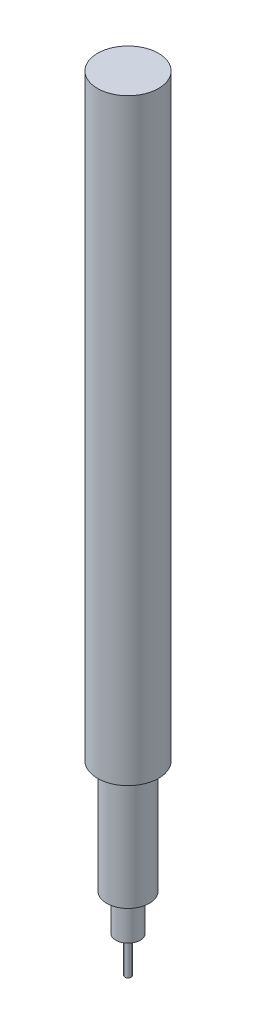
ISO-10303-21;
HEADER;
FILE_DESCRIPTION(('STEP AP214'),'2;1');
FILE_NAME('part.step','',(''),(''),'','','');
FILE_SCHEMA(('AUTOMOTIVE_DESIGN { 1 0 10303 214 1 1 1 1 }'));
ENDSEC;
DATA;
#1=APPLICATION_CONTEXT('core data for automotive mechanical design processes');
#2=APPLICATION_PROTOCOL_DEFINITION('international standard','automotive_design',2000,#1);
#3=PRODUCT_CONTEXT('',#1,'mechanical');
#4=PRODUCT('Part','Part','',(#3));
#5=PRODUCT_RELATED_PRODUCT_CATEGORY('part','',(#4));
#6=PRODUCT_DEFINITION_FORMATION('','',#4);
#7=PRODUCT_DEFINITION_CONTEXT('part definition',#1,'design');
#8=PRODUCT_DEFINITION('design','',#6,#7);
#9=PRODUCT_DEFINITION_SHAPE('','',#8);
#10=(LENGTH_UNIT() NAMED_UNIT(*) SI_UNIT(.MILLI.,.METRE.));
#11=(NAMED_UNIT(*) PLANE_ANGLE_UNIT() SI_UNIT($,.RADIAN.));
#12=(NAMED_UNIT(*) SI_UNIT($,.STERADIAN.) SOLID_ANGLE_UNIT());
#13=UNCERTAINTY_MEASURE_WITH_UNIT(LENGTH_MEASURE(1.E-05),#10,'distance_accuracy_value','');
#14=(GEOMETRIC_REPRESENTATION_CONTEXT(3) GLOBAL_UNCERTAINTY_ASSIGNED_CONTEXT((#13)) GLOBAL_UNIT_ASSIGNED_CONTEXT((#10,
#11,#12)) REPRESENTATION_CONTEXT('',''));
#15=CARTESIAN_POINT('',(0.,0.,0.));
#16=DIRECTION('',(0.,0.,1.));
#17=DIRECTION('',(1.,0.,0.));
#18=AXIS2_PLACEMENT_3D('',#15,#16,#17);
#19=CARTESIAN_POINT('',(0.,0.,0.));
#20=DIRECTION('',(0.,-1.,0.));
#21=DIRECTION('',(0.,0.,-1.));
#22=AXIS2_PLACEMENT_3D('',#19,#20,#21);
#23=PLANE('',#22);
#24=CARTESIAN_POINT('',(0.,0.,0.));
#25=DIRECTION('',(0.,-1.,0.));
#26=DIRECTION('',(0.,0.,-1.));
#27=AXIS2_PLACEMENT_3D('',#24,#25,#26);
#28=CIRCLE('',#27,0.5);
#29=CARTESIAN_POINT('',(0.,0.,-0.5));
#30=VERTEX_POINT('',#29);
#31=EDGE_CURVE('E10',#30,#30,#28,.T.);
#32=ORIENTED_EDGE('',*,*,#31,.T.);
#33=EDGE_LOOP('',(#32));
#34=FACE_BOUND('',#33,.T.);
#35=ADVANCED_FACE('F31',(#34),#23,.T.);
#36=CARTESIAN_POINT('',(0.,0.,0.));
#37=DIRECTION('',(0.,-1.,0.));
#38=DIRECTION('',(0.,0.,-1.));
#39=AXIS2_PLACEMENT_3D('',#36,#37,#38);
#40=CYLINDRICAL_SURFACE('',#39,0.5);
#41=CARTESIAN_POINT('',(0.,5.,0.));
#42=DIRECTION('',(0.,-1.,0.));
#43=DIRECTION('',(0.,0.,-1.));
#44=AXIS2_PLACEMENT_3D('',#41,#42,#43);
#45=CIRCLE('',#44,0.5);
#46=CARTESIAN_POINT('',(0.,5.,-0.5));
#47=VERTEX_POINT('',#46);
#48=EDGE_CURVE('E37',#47,#47,#45,.T.);
#49=ORIENTED_EDGE('',*,*,#48,.T.);
#50=EDGE_LOOP('',(#49));
#51=FACE_BOUND('',#50,.T.);
#52=ORIENTED_EDGE('',*,*,#31,.F.);
#53=EDGE_LOOP('',(#52));
#54=FACE_BOUND('',#53,.T.);
#55=ADVANCED_FACE('F75',(#51,#54),#40,.T.);
#56=CARTESIAN_POINT('',(0.,5.,0.));
#57=DIRECTION('',(0.,1.,0.));
#58=DIRECTION('',(0.,0.,1.));
#59=AXIS2_PLACEMENT_3D('',#56,#57,#58);
#60=CONICAL_SURFACE('',#59,0.5,0.982793723247329);
#61=CARTESIAN_POINT('',(0.,6.,0.));
#62=DIRECTION('',(0.,-1.,0.));
#63=DIRECTION('',(0.,0.,-1.));
#64=AXIS2_PLACEMENT_3D('',#61,#62,#63);
#65=CIRCLE('',#64,2.);
#66=CARTESIAN_POINT('',(0.,6.,-2.));
#67=VERTEX_POINT('',#66);
#68=EDGE_CURVE('E41',#67,#67,#65,.T.);
#69=ORIENTED_EDGE('',*,*,#68,.T.);
#70=EDGE_LOOP('',(#69));
#71=FACE_BOUND('',#70,.T.);
#72=ORIENTED_EDGE('',*,*,#48,.F.);
#73=EDGE_LOOP('',(#72));
#74=FACE_BOUND('',#73,.T.);
#75=ADVANCED_FACE('F79',(#71,#74),#60,.T.);
#76=CARTESIAN_POINT('',(0.,0.,0.));
#77=DIRECTION('',(0.,-1.,0.));
#78=DIRECTION('',(0.,0.,-1.));
#79=AXIS2_PLACEMENT_3D('',#76,#77,#78);
#80=CYLINDRICAL_SURFACE('',#79,2.);
#81=CARTESIAN_POINT('',(0.,12.,0.));
#82=DIRECTION('',(0.,-1.,0.));
#83=DIRECTION('',(0.,0.,-1.));
#84=AXIS2_PLACEMENT_3D('',#81,#82,#83);
#85=CIRCLE('',#84,2.);
#86=CARTESIAN_POINT('',(0.,12.,-2.));
#87=VERTEX_POINT('',#86);
#88=EDGE_CURVE('E45',#87,#87,#85,.T.);
#89=ORIENTED_EDGE('',*,*,#88,.T.);
#90=EDGE_LOOP('',(#89));
#91=FACE_BOUND('',#90,.T.);
#92=ORIENTED_EDGE('',*,*,#68,.F.);
#93=EDGE_LOOP('',(#92));
#94=FACE_BOUND('',#93,.T.);
#95=ADVANCED_FACE('F83',(#91,#94),#80,.T.);
#96=CARTESIAN_POINT('',(2.,12.,0.));
#97=DIRECTION('',(0.,-1.,0.));
#98=DIRECTION('',(0.,0.,-1.));
#99=AXIS2_PLACEMENT_3D('',#96,#97,#98);
#100=PLANE('',#99);
#101=CARTESIAN_POINT('',(0.,12.,0.));
#102=DIRECTION('',(0.,-1.,0.));
#103=DIRECTION('',(0.,0.,-1.));
#104=AXIS2_PLACEMENT_3D('',#101,#102,#103);
#105=CIRCLE('',#104,3.5);
#106=CARTESIAN_POINT('',(0.,12.,-3.5));
#107=VERTEX_POINT('',#106);
#108=EDGE_CURVE('E50',#107,#107,#105,.T.);
#109=ORIENTED_EDGE('',*,*,#108,.T.);
#110=EDGE_LOOP('',(#109));
#111=FACE_BOUND('',#110,.T.);
#112=ORIENTED_EDGE('',*,*,#88,.F.);
#113=EDGE_LOOP('',(#112));
#114=FACE_BOUND('',#113,.T.);
#115=ADVANCED_FACE('F90',(#111,#114),#100,.T.);
#116=CARTESIAN_POINT('',(0.,0.,0.));
#117=DIRECTION('',(0.,-1.,0.));
#118=DIRECTION('',(0.,0.,-1.));
#119=AXIS2_PLACEMENT_3D('',#116,#117,#118);
#120=CYLINDRICAL_SURFACE('',#119,3.5);
#121=CARTESIAN_POINT('',(0.,30.5,0.));
#122=DIRECTION('',(0.,-1.,0.));
#123=DIRECTION('',(0.,0.,-1.));
#124=AXIS2_PLACEMENT_3D('',#121,#122,#123);
#125=CIRCLE('',#124,3.5);
#126=CARTESIAN_POINT('',(0.,30.5,-3.5));
#127=VERTEX_POINT('',#126);
#128=EDGE_CURVE('E53',#127,#127,#125,.T.);
#129=ORIENTED_EDGE('',*,*,#128,.T.);
#130=EDGE_LOOP('',(#129));
#131=FACE_BOUND('',#130,.T.);
#132=ORIENTED_EDGE('',*,*,#108,.F.);
#133=EDGE_LOOP('',(#132));
#134=FACE_BOUND('',#133,.T.);
#135=ADVANCED_FACE('F94',(#131,#134),#120,.T.);
#136=CARTESIAN_POINT('',(3.5,30.5,0.));
#137=DIRECTION('',(0.,-1.,0.));
#138=DIRECTION('',(0.,0.,-1.));
#139=AXIS2_PLACEMENT_3D('',#136,#137,#138);
#140=PLANE('',#139);
#141=CARTESIAN_POINT('',(0.,30.5,0.));
#142=DIRECTION('',(0.,-1.,0.));
#143=DIRECTION('',(0.,0.,-1.));
#144=AXIS2_PLACEMENT_3D('',#141,#142,#143);
#145=CIRCLE('',#144,5.);
#146=CARTESIAN_POINT('',(0.,30.5,-5.));
#147=VERTEX_POINT('',#146);
#148=EDGE_CURVE('E56',#147,#147,#145,.T.);
#149=ORIENTED_EDGE('',*,*,#148,.T.);
#150=EDGE_LOOP('',(#149));
#151=FACE_BOUND('',#150,.T.);
#152=ORIENTED_EDGE('',*,*,#128,.F.);
#153=EDGE_LOOP('',(#152));
#154=FACE_BOUND('',#153,.T.);
#155=ADVANCED_FACE('F72',(#151,#154),#140,.T.);
#156=CARTESIAN_POINT('',(0.,0.,0.));
#157=DIRECTION('',(0.,-1.,0.));
#158=DIRECTION('',(0.,0.,-1.));
#159=AXIS2_PLACEMENT_3D('',#156,#157,#158);
#160=CYLINDRICAL_SURFACE('',#159,5.);
#161=CARTESIAN_POINT('',(0.,128.5,0.));
#162=DIRECTION('',(0.,-1.,0.));
#163=DIRECTION('',(0.,0.,-1.));
#164=AXIS2_PLACEMENT_3D('',#161,#162,#163);
#165=CIRCLE('',#164,5.);
#166=CARTESIAN_POINT('',(0.,128.5,-5.));
#167=VERTEX_POINT('',#166);
#168=EDGE_CURVE('E59',#167,#167,#165,.T.);
#169=ORIENTED_EDGE('',*,*,#168,.T.);
#170=EDGE_LOOP('',(#169));
#171=FACE_BOUND('',#170,.T.);
#172=ORIENTED_EDGE('',*,*,#148,.F.);
#173=EDGE_LOOP('',(#172));
#174=FACE_BOUND('',#173,.T.);
#175=ADVANCED_FACE('F63',(#171,#174),#160,.T.);
#176=CARTESIAN_POINT('',(5.,128.5,0.));
#177=DIRECTION('',(0.,1.,0.));
#178=DIRECTION('',(0.,0.,1.));
#179=AXIS2_PLACEMENT_3D('',#176,#177,#178);
#180=PLANE('',#179);
#181=ORIENTED_EDGE('',*,*,#168,.F.);
#182=EDGE_LOOP('',(#181));
#183=FACE_BOUND('',#182,.T.);
#184=ADVANCED_FACE('F66',(#183),#180,.T.);
#185=CLOSED_SHELL('',(#35,#55,#75,#95,#115,#135,#155,#175,#184));
#186=MANIFOLD_SOLID_BREP('B2',#185);
#187=ADVANCED_BREP_SHAPE_REPRESENTATION('',(#18,#186),#14);
#188=SHAPE_DEFINITION_REPRESENTATION(#9,#187);
ENDSEC;
END-ISO-10303-21;
